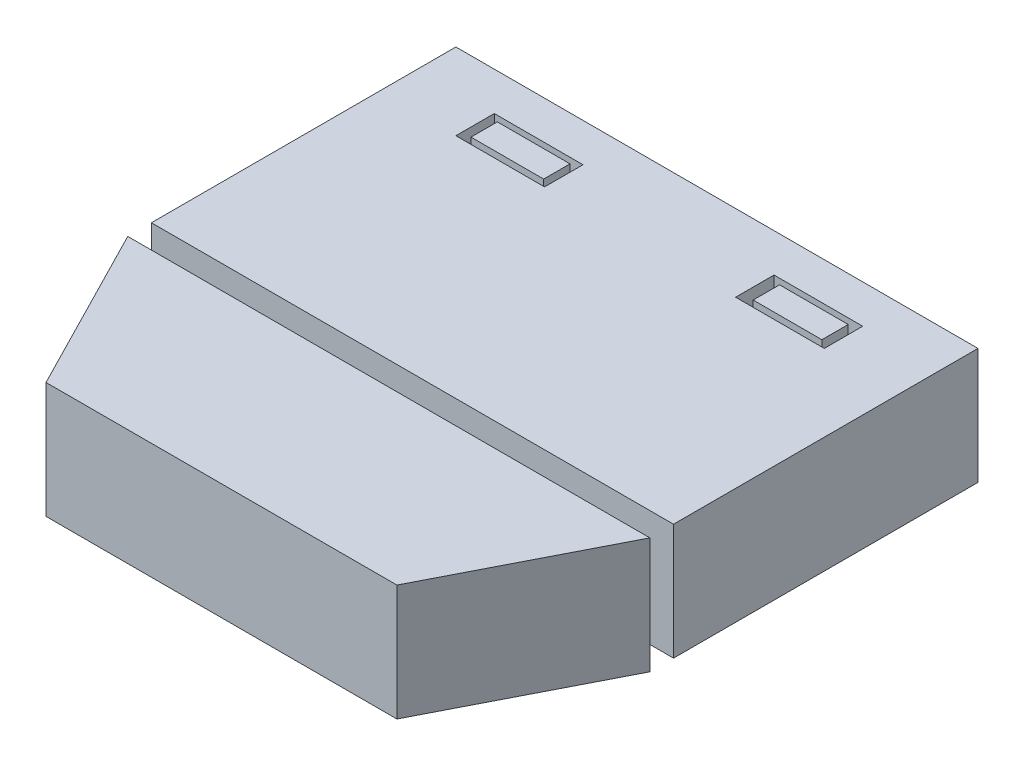
ISO-10303-21;
HEADER;
FILE_DESCRIPTION(('STEP AP214'),'2;1');
FILE_NAME('part.step','',(''),(''),'','','');
FILE_SCHEMA(('AUTOMOTIVE_DESIGN { 1 0 10303 214 1 1 1 1 }'));
ENDSEC;
DATA;
#1=APPLICATION_CONTEXT('core data for automotive mechanical design processes');
#2=APPLICATION_PROTOCOL_DEFINITION('international standard','automotive_design',2000,#1);
#3=PRODUCT_CONTEXT('',#1,'mechanical');
#4=PRODUCT('Part','Part','',(#3));
#5=PRODUCT_RELATED_PRODUCT_CATEGORY('part','',(#4));
#6=PRODUCT_DEFINITION_FORMATION('','',#4);
#7=PRODUCT_DEFINITION_CONTEXT('part definition',#1,'design');
#8=PRODUCT_DEFINITION('design','',#6,#7);
#9=PRODUCT_DEFINITION_SHAPE('','',#8);
#10=(LENGTH_UNIT() NAMED_UNIT(*) SI_UNIT(.MILLI.,.METRE.));
#11=(NAMED_UNIT(*) PLANE_ANGLE_UNIT() SI_UNIT($,.RADIAN.));
#12=(NAMED_UNIT(*) SI_UNIT($,.STERADIAN.) SOLID_ANGLE_UNIT());
#13=UNCERTAINTY_MEASURE_WITH_UNIT(LENGTH_MEASURE(1.E-05),#10,'distance_accuracy_value','');
#14=(GEOMETRIC_REPRESENTATION_CONTEXT(3) GLOBAL_UNCERTAINTY_ASSIGNED_CONTEXT((#13)) GLOBAL_UNIT_ASSIGNED_CONTEXT((#10,
#11,#12)) REPRESENTATION_CONTEXT('',''));
#15=CARTESIAN_POINT('',(0.,0.,0.));
#16=DIRECTION('',(0.,0.,1.));
#17=DIRECTION('',(1.,0.,0.));
#18=AXIS2_PLACEMENT_3D('',#15,#16,#17);
#19=CARTESIAN_POINT('',(37.6223812938265,10.,0.));
#20=DIRECTION('',(1.,0.,0.));
#21=DIRECTION('',(0.,0.,-1.));
#22=AXIS2_PLACEMENT_3D('',#19,#20,#21);
#23=PLANE('',#22);
#24=DIRECTION('',(0.,0.,1.));
#25=VECTOR('',#24,1.);
#26=CARTESIAN_POINT('',(37.6223812938265,0.,0.));
#27=LINE('',#26,#25);
#28=CARTESIAN_POINT('',(37.6223812938265,0.,-36.1945227365171));
#29=VERTEX_POINT('',#28);
#30=CARTESIAN_POINT('',(37.6223812938265,0.,-33.9231361325053));
#31=VERTEX_POINT('',#30);
#32=EDGE_CURVE('E160',#29,#31,#27,.T.);
#33=ORIENTED_EDGE('',*,*,#32,.F.);
#34=DIRECTION('',(0.,-1.,0.));
#35=VECTOR('',#34,1.);
#36=CARTESIAN_POINT('',(37.6223812938265,10.,-36.1945227365171));
#37=LINE('',#36,#35);
#38=CARTESIAN_POINT('',(37.6223812938265,10.,-36.1945227365171));
#39=VERTEX_POINT('',#38);
#40=EDGE_CURVE('E13',#39,#29,#37,.T.);
#41=ORIENTED_EDGE('',*,*,#40,.F.);
#42=DIRECTION('',(0.,0.,1.));
#43=VECTOR('',#42,1.);
#44=CARTESIAN_POINT('',(37.6223812938265,10.,0.));
#45=LINE('',#44,#43);
#46=CARTESIAN_POINT('',(37.6223812938265,10.,-33.9231361325053));
#47=VERTEX_POINT('',#46);
#48=EDGE_CURVE('E154',#39,#47,#45,.T.);
#49=ORIENTED_EDGE('',*,*,#48,.T.);
#50=DIRECTION('',(0.,-1.,0.));
#51=VECTOR('',#50,1.);
#52=CARTESIAN_POINT('',(37.6223812938265,10.,-33.9231361325053));
#53=LINE('',#52,#51);
#54=EDGE_CURVE('E135',#47,#31,#53,.T.);
#55=ORIENTED_EDGE('',*,*,#54,.T.);
#56=EDGE_LOOP('',(#33,#41,#49,#55));
#57=FACE_BOUND('',#56,.T.);
#58=ADVANCED_FACE('F97',(#57),#23,.T.);
#59=CARTESIAN_POINT('',(0.,10.,-36.1945227365171));
#60=DIRECTION('',(0.,0.,-1.));
#61=DIRECTION('',(-1.,0.,0.));
#62=AXIS2_PLACEMENT_3D('',#59,#60,#61);
#63=PLANE('',#62);
#64=DIRECTION('',(1.,0.,0.));
#65=VECTOR('',#64,1.);
#66=CARTESIAN_POINT('',(0.,0.,-36.1945227365171));
#67=LINE('',#66,#65);
#68=CARTESIAN_POINT('',(31.6991157462479,0.,-36.1945227365171));
#69=VERTEX_POINT('',#68);
#70=EDGE_CURVE('E148',#69,#29,#67,.T.);
#71=ORIENTED_EDGE('',*,*,#70,.F.);
#72=DIRECTION('',(0.,-1.,0.));
#73=VECTOR('',#72,1.);
#74=CARTESIAN_POINT('',(31.6991157462479,10.,-36.1945227365171));
#75=LINE('',#74,#73);
#76=CARTESIAN_POINT('',(31.6991157462479,10.,-36.1945227365171));
#77=VERTEX_POINT('',#76);
#78=EDGE_CURVE('E105',#77,#69,#75,.T.);
#79=ORIENTED_EDGE('',*,*,#78,.F.);
#80=DIRECTION('',(1.,0.,0.));
#81=VECTOR('',#80,1.);
#82=CARTESIAN_POINT('',(0.,10.,-36.1945227365171));
#83=LINE('',#82,#81);
#84=EDGE_CURVE('E146',#77,#39,#83,.T.);
#85=ORIENTED_EDGE('',*,*,#84,.T.);
#86=ORIENTED_EDGE('',*,*,#40,.T.);
#87=EDGE_LOOP('',(#71,#79,#85,#86));
#88=FACE_BOUND('',#87,.T.);
#89=ADVANCED_FACE('F144',(#88),#63,.T.);
#90=CARTESIAN_POINT('',(31.6991157462479,10.,0.));
#91=DIRECTION('',(1.,0.,0.));
#92=DIRECTION('',(0.,0.,-1.));
#93=AXIS2_PLACEMENT_3D('',#90,#91,#92);
#94=PLANE('',#93);
#95=DIRECTION('',(0.,0.,1.));
#96=VECTOR('',#95,1.);
#97=CARTESIAN_POINT('',(31.6991157462479,0.,0.));
#98=LINE('',#97,#96);
#99=CARTESIAN_POINT('',(31.6991157462479,0.,-33.9231361325053));
#100=VERTEX_POINT('',#99);
#101=EDGE_CURVE('E128',#69,#100,#98,.T.);
#102=ORIENTED_EDGE('',*,*,#101,.T.);
#103=DIRECTION('',(0.,-1.,0.));
#104=VECTOR('',#103,1.);
#105=CARTESIAN_POINT('',(31.6991157462479,10.,-33.9231361325053));
#106=LINE('',#105,#104);
#107=CARTESIAN_POINT('',(31.6991157462479,10.,-33.9231361325053));
#108=VERTEX_POINT('',#107);
#109=EDGE_CURVE('E149',#108,#100,#106,.T.);
#110=ORIENTED_EDGE('',*,*,#109,.F.);
#111=DIRECTION('',(0.,0.,1.));
#112=VECTOR('',#111,1.);
#113=CARTESIAN_POINT('',(31.6991157462479,10.,0.));
#114=LINE('',#113,#112);
#115=EDGE_CURVE('E150',#77,#108,#114,.T.);
#116=ORIENTED_EDGE('',*,*,#115,.F.);
#117=ORIENTED_EDGE('',*,*,#78,.T.);
#118=EDGE_LOOP('',(#102,#110,#116,#117));
#119=FACE_BOUND('',#118,.T.);
#120=ADVANCED_FACE('F151',(#119),#94,.F.);
#121=CARTESIAN_POINT('',(0.,10.,-33.9231361325053));
#122=DIRECTION('',(0.,0.,-1.));
#123=DIRECTION('',(-1.,0.,0.));
#124=AXIS2_PLACEMENT_3D('',#121,#122,#123);
#125=PLANE('',#124);
#126=DIRECTION('',(1.,0.,0.));
#127=VECTOR('',#126,1.);
#128=CARTESIAN_POINT('',(0.,0.,-33.9231361325053));
#129=LINE('',#128,#127);
#130=EDGE_CURVE('E156',#100,#31,#129,.T.);
#131=ORIENTED_EDGE('',*,*,#130,.T.);
#132=ORIENTED_EDGE('',*,*,#54,.F.);
#133=DIRECTION('',(1.,0.,0.));
#134=VECTOR('',#133,1.);
#135=CARTESIAN_POINT('',(0.,10.,-33.9231361325053));
#136=LINE('',#135,#134);
#137=EDGE_CURVE('E113',#108,#47,#136,.T.);
#138=ORIENTED_EDGE('',*,*,#137,.F.);
#139=ORIENTED_EDGE('',*,*,#109,.T.);
#140=EDGE_LOOP('',(#131,#132,#138,#139));
#141=FACE_BOUND('',#140,.T.);
#142=ADVANCED_FACE('F169',(#141),#125,.F.);
#143=CARTESIAN_POINT('',(0.,10.,0.));
#144=DIRECTION('',(0.,1.,0.));
#145=DIRECTION('',(0.,0.,1.));
#146=AXIS2_PLACEMENT_3D('',#143,#144,#145);
#147=PLANE('',#146);
#148=ORIENTED_EDGE('',*,*,#48,.F.);
#149=ORIENTED_EDGE('',*,*,#84,.F.);
#150=ORIENTED_EDGE('',*,*,#115,.T.);
#151=ORIENTED_EDGE('',*,*,#137,.T.);
#152=EDGE_LOOP('',(#148,#149,#150,#151));
#153=FACE_BOUND('',#152,.T.);
#154=ADVANCED_FACE('F153',(#153),#147,.T.);
#155=CARTESIAN_POINT('',(0.,0.,0.));
#156=DIRECTION('',(0.,1.,0.));
#157=DIRECTION('',(0.,0.,1.));
#158=AXIS2_PLACEMENT_3D('',#155,#156,#157);
#159=PLANE('',#158);
#160=ORIENTED_EDGE('',*,*,#32,.T.);
#161=ORIENTED_EDGE('',*,*,#130,.F.);
#162=ORIENTED_EDGE('',*,*,#101,.F.);
#163=ORIENTED_EDGE('',*,*,#70,.T.);
#164=EDGE_LOOP('',(#160,#161,#162,#163));
#165=FACE_BOUND('',#164,.T.);
#166=ADVANCED_FACE('F171',(#165),#159,.F.);
#167=CLOSED_SHELL('',(#58,#89,#120,#142,#154,#166));
#168=MANIFOLD_SOLID_BREP('B2',#167);
#169=CARTESIAN_POINT('',(13.6415922443539,10.,0.));
#170=DIRECTION('',(1.,0.,0.));
#171=DIRECTION('',(0.,0.,-1.));
#172=AXIS2_PLACEMENT_3D('',#169,#170,#171);
#173=PLANE('',#172);
#174=DIRECTION('',(0.,0.,1.));
#175=VECTOR('',#174,1.);
#176=CARTESIAN_POINT('',(13.6415922443539,0.,0.));
#177=LINE('',#176,#175);
#178=CARTESIAN_POINT('',(13.6415922443539,0.,-36.1945227365171));
#179=VERTEX_POINT('',#178);
#180=CARTESIAN_POINT('',(13.6415922443539,0.,-33.9231361325053));
#181=VERTEX_POINT('',#180);
#182=EDGE_CURVE('E305',#179,#181,#177,.T.);
#183=ORIENTED_EDGE('',*,*,#182,.F.);
#184=DIRECTION('',(0.,-1.,0.));
#185=VECTOR('',#184,1.);
#186=CARTESIAN_POINT('',(13.6415922443539,10.,-36.1945227365171));
#187=LINE('',#186,#185);
#188=CARTESIAN_POINT('',(13.6415922443539,10.,-36.1945227365171));
#189=VERTEX_POINT('',#188);
#190=EDGE_CURVE('E95',#189,#179,#187,.T.);
#191=ORIENTED_EDGE('',*,*,#190,.F.);
#192=DIRECTION('',(0.,0.,1.));
#193=VECTOR('',#192,1.);
#194=CARTESIAN_POINT('',(13.6415922443539,10.,0.));
#195=LINE('',#194,#193);
#196=CARTESIAN_POINT('',(13.6415922443539,10.,-33.9231361325053));
#197=VERTEX_POINT('',#196);
#198=EDGE_CURVE('E299',#189,#197,#195,.T.);
#199=ORIENTED_EDGE('',*,*,#198,.T.);
#200=DIRECTION('',(0.,-1.,0.));
#201=VECTOR('',#200,1.);
#202=CARTESIAN_POINT('',(13.6415922443539,10.,-33.9231361325053));
#203=LINE('',#202,#201);
#204=EDGE_CURVE('E280',#197,#181,#203,.T.);
#205=ORIENTED_EDGE('',*,*,#204,.T.);
#206=EDGE_LOOP('',(#183,#191,#199,#205));
#207=FACE_BOUND('',#206,.T.);
#208=ADVANCED_FACE('F242',(#207),#173,.T.);
#209=CARTESIAN_POINT('',(0.,10.,-36.1945227365171));
#210=DIRECTION('',(0.,0.,-1.));
#211=DIRECTION('',(-1.,0.,0.));
#212=AXIS2_PLACEMENT_3D('',#209,#210,#211);
#213=PLANE('',#212);
#214=DIRECTION('',(1.,0.,0.));
#215=VECTOR('',#214,1.);
#216=CARTESIAN_POINT('',(0.,0.,-36.1945227365171));
#217=LINE('',#216,#215);
#218=CARTESIAN_POINT('',(7.3776187061735,0.,-36.1945227365171));
#219=VERTEX_POINT('',#218);
#220=EDGE_CURVE('E293',#219,#179,#217,.T.);
#221=ORIENTED_EDGE('',*,*,#220,.F.);
#222=DIRECTION('',(0.,-1.,0.));
#223=VECTOR('',#222,1.);
#224=CARTESIAN_POINT('',(7.3776187061735,10.,-36.1945227365171));
#225=LINE('',#224,#223);
#226=CARTESIAN_POINT('',(7.3776187061735,10.,-36.1945227365171));
#227=VERTEX_POINT('',#226);
#228=EDGE_CURVE('E250',#227,#219,#225,.T.);
#229=ORIENTED_EDGE('',*,*,#228,.F.);
#230=DIRECTION('',(1.,0.,0.));
#231=VECTOR('',#230,1.);
#232=CARTESIAN_POINT('',(0.,10.,-36.1945227365171));
#233=LINE('',#232,#231);
#234=EDGE_CURVE('E291',#227,#189,#233,.T.);
#235=ORIENTED_EDGE('',*,*,#234,.T.);
#236=ORIENTED_EDGE('',*,*,#190,.T.);
#237=EDGE_LOOP('',(#221,#229,#235,#236));
#238=FACE_BOUND('',#237,.T.);
#239=ADVANCED_FACE('F289',(#238),#213,.T.);
#240=CARTESIAN_POINT('',(7.3776187061735,10.,0.));
#241=DIRECTION('',(1.,0.,0.));
#242=DIRECTION('',(0.,0.,-1.));
#243=AXIS2_PLACEMENT_3D('',#240,#241,#242);
#244=PLANE('',#243);
#245=DIRECTION('',(0.,0.,1.));
#246=VECTOR('',#245,1.);
#247=CARTESIAN_POINT('',(7.3776187061735,0.,0.));
#248=LINE('',#247,#246);
#249=CARTESIAN_POINT('',(7.3776187061735,0.,-33.9231361325053));
#250=VERTEX_POINT('',#249);
#251=EDGE_CURVE('E273',#219,#250,#248,.T.);
#252=ORIENTED_EDGE('',*,*,#251,.T.);
#253=DIRECTION('',(0.,-1.,0.));
#254=VECTOR('',#253,1.);
#255=CARTESIAN_POINT('',(7.3776187061735,10.,-33.9231361325053));
#256=LINE('',#255,#254);
#257=CARTESIAN_POINT('',(7.3776187061735,10.,-33.9231361325053));
#258=VERTEX_POINT('',#257);
#259=EDGE_CURVE('E294',#258,#250,#256,.T.);
#260=ORIENTED_EDGE('',*,*,#259,.F.);
#261=DIRECTION('',(0.,0.,1.));
#262=VECTOR('',#261,1.);
#263=CARTESIAN_POINT('',(7.3776187061735,10.,0.));
#264=LINE('',#263,#262);
#265=EDGE_CURVE('E295',#227,#258,#264,.T.);
#266=ORIENTED_EDGE('',*,*,#265,.F.);
#267=ORIENTED_EDGE('',*,*,#228,.T.);
#268=EDGE_LOOP('',(#252,#260,#266,#267));
#269=FACE_BOUND('',#268,.T.);
#270=ADVANCED_FACE('F296',(#269),#244,.F.);
#271=CARTESIAN_POINT('',(0.,10.,-33.9231361325053));
#272=DIRECTION('',(0.,0.,-1.));
#273=DIRECTION('',(-1.,0.,0.));
#274=AXIS2_PLACEMENT_3D('',#271,#272,#273);
#275=PLANE('',#274);
#276=DIRECTION('',(1.,0.,0.));
#277=VECTOR('',#276,1.);
#278=CARTESIAN_POINT('',(0.,0.,-33.9231361325053));
#279=LINE('',#278,#277);
#280=EDGE_CURVE('E301',#250,#181,#279,.T.);
#281=ORIENTED_EDGE('',*,*,#280,.T.);
#282=ORIENTED_EDGE('',*,*,#204,.F.);
#283=DIRECTION('',(1.,0.,0.));
#284=VECTOR('',#283,1.);
#285=CARTESIAN_POINT('',(0.,10.,-33.9231361325053));
#286=LINE('',#285,#284);
#287=EDGE_CURVE('E258',#258,#197,#286,.T.);
#288=ORIENTED_EDGE('',*,*,#287,.F.);
#289=ORIENTED_EDGE('',*,*,#259,.T.);
#290=EDGE_LOOP('',(#281,#282,#288,#289));
#291=FACE_BOUND('',#290,.T.);
#292=ADVANCED_FACE('F314',(#291),#275,.F.);
#293=CARTESIAN_POINT('',(0.,10.,0.));
#294=DIRECTION('',(0.,1.,0.));
#295=DIRECTION('',(0.,0.,1.));
#296=AXIS2_PLACEMENT_3D('',#293,#294,#295);
#297=PLANE('',#296);
#298=ORIENTED_EDGE('',*,*,#198,.F.);
#299=ORIENTED_EDGE('',*,*,#234,.F.);
#300=ORIENTED_EDGE('',*,*,#265,.T.);
#301=ORIENTED_EDGE('',*,*,#287,.T.);
#302=EDGE_LOOP('',(#298,#299,#300,#301));
#303=FACE_BOUND('',#302,.T.);
#304=ADVANCED_FACE('F298',(#303),#297,.T.);
#305=CARTESIAN_POINT('',(0.,0.,0.));
#306=DIRECTION('',(0.,1.,0.));
#307=DIRECTION('',(0.,0.,1.));
#308=AXIS2_PLACEMENT_3D('',#305,#306,#307);
#309=PLANE('',#308);
#310=ORIENTED_EDGE('',*,*,#182,.T.);
#311=ORIENTED_EDGE('',*,*,#280,.F.);
#312=ORIENTED_EDGE('',*,*,#251,.F.);
#313=ORIENTED_EDGE('',*,*,#220,.T.);
#314=EDGE_LOOP('',(#310,#311,#312,#313));
#315=FACE_BOUND('',#314,.T.);
#316=ADVANCED_FACE('F316',(#315),#309,.F.);
#317=CLOSED_SHELL('',(#208,#239,#270,#292,#304,#316));
#318=MANIFOLD_SOLID_BREP('B7',#317);
#319=CARTESIAN_POINT('',(0.,10.,-13.7579617834395));
#320=DIRECTION('',(0.,0.,-1.));
#321=DIRECTION('',(-1.,0.,0.));
#322=AXIS2_PLACEMENT_3D('',#319,#320,#321);
#323=PLANE('',#322);
#324=DIRECTION('',(1.,0.,0.));
#325=VECTOR('',#324,1.);
#326=CARTESIAN_POINT('',(0.,0.,-13.7579617834395));
#327=LINE('',#326,#325);
#328=CARTESIAN_POINT('',(0.,0.,-13.7579617834395));
#329=VERTEX_POINT('',#328);
#330=CARTESIAN_POINT('',(45.,0.,-13.7579617834395));
#331=VERTEX_POINT('',#330);
#332=EDGE_CURVE('E529',#329,#331,#327,.T.);
#333=ORIENTED_EDGE('',*,*,#332,.T.);
#334=DIRECTION('',(0.,-1.,0.));
#335=VECTOR('',#334,1.);
#336=CARTESIAN_POINT('',(45.,10.,-13.7579617834395));
#337=LINE('',#336,#335);
#338=CARTESIAN_POINT('',(45.,10.,-13.7579617834395));
#339=VERTEX_POINT('',#338);
#340=EDGE_CURVE('E240',#339,#331,#337,.T.);
#341=ORIENTED_EDGE('',*,*,#340,.F.);
#342=DIRECTION('',(1.,0.,0.));
#343=VECTOR('',#342,1.);
#344=CARTESIAN_POINT('',(0.,10.,-13.7579617834395));
#345=LINE('',#344,#343);
#346=CARTESIAN_POINT('',(0.,10.,-13.7579617834395));
#347=VERTEX_POINT('',#346);
#348=EDGE_CURVE('E489',#347,#339,#345,.T.);
#349=ORIENTED_EDGE('',*,*,#348,.F.);
#350=DIRECTION('',(0.,-1.,0.));
#351=VECTOR('',#350,1.);
#352=CARTESIAN_POINT('',(0.,10.,-13.7579617834395));
#353=LINE('',#352,#351);
#354=EDGE_CURVE('E405',#347,#329,#353,.T.);
#355=ORIENTED_EDGE('',*,*,#354,.T.);
#356=EDGE_LOOP('',(#333,#341,#349,#355));
#357=FACE_BOUND('',#356,.T.);
#358=ADVANCED_FACE('F386',(#357),#323,.F.);
#359=CARTESIAN_POINT('',(45.,10.,0.));
#360=DIRECTION('',(-1.,0.,0.));
#361=DIRECTION('',(0.,0.,1.));
#362=AXIS2_PLACEMENT_3D('',#359,#360,#361);
#363=PLANE('',#362);
#364=DIRECTION('',(0.,0.,-1.));
#365=VECTOR('',#364,1.);
#366=CARTESIAN_POINT('',(45.,0.,0.));
#367=LINE('',#366,#365);
#368=CARTESIAN_POINT('',(45.,0.,-40.));
#369=VERTEX_POINT('',#368);
#370=EDGE_CURVE('E495',#331,#369,#367,.T.);
#371=ORIENTED_EDGE('',*,*,#370,.T.);
#372=DIRECTION('',(0.,-1.,0.));
#373=VECTOR('',#372,1.);
#374=CARTESIAN_POINT('',(45.,10.,-40.));
#375=LINE('',#374,#373);
#376=CARTESIAN_POINT('',(45.,10.,-40.));
#377=VERTEX_POINT('',#376);
#378=EDGE_CURVE('E396',#377,#369,#375,.T.);
#379=ORIENTED_EDGE('',*,*,#378,.F.);
#380=DIRECTION('',(0.,0.,-1.));
#381=VECTOR('',#380,1.);
#382=CARTESIAN_POINT('',(45.,10.,0.));
#383=LINE('',#382,#381);
#384=EDGE_CURVE('E483',#339,#377,#383,.T.);
#385=ORIENTED_EDGE('',*,*,#384,.F.);
#386=ORIENTED_EDGE('',*,*,#340,.T.);
#387=EDGE_LOOP('',(#371,#379,#385,#386));
#388=FACE_BOUND('',#387,.T.);
#389=ADVANCED_FACE('F494',(#388),#363,.F.);
#390=CARTESIAN_POINT('',(0.,10.,-40.));
#391=DIRECTION('',(0.,0.,-1.));
#392=DIRECTION('',(-1.,0.,0.));
#393=AXIS2_PLACEMENT_3D('',#390,#391,#392);
#394=PLANE('',#393);
#395=DIRECTION('',(1.,0.,0.));
#396=VECTOR('',#395,1.);
#397=CARTESIAN_POINT('',(0.,0.,-40.));
#398=LINE('',#397,#396);
#399=CARTESIAN_POINT('',(0.,0.,-40.));
#400=VERTEX_POINT('',#399);
#401=EDGE_CURVE('E532',#400,#369,#398,.T.);
#402=ORIENTED_EDGE('',*,*,#401,.F.);
#403=DIRECTION('',(0.,-1.,0.));
#404=VECTOR('',#403,1.);
#405=CARTESIAN_POINT('',(0.,10.,-40.));
#406=LINE('',#405,#404);
#407=CARTESIAN_POINT('',(0.,10.,-40.));
#408=VERTEX_POINT('',#407);
#409=EDGE_CURVE('E443',#408,#400,#406,.T.);
#410=ORIENTED_EDGE('',*,*,#409,.F.);
#411=DIRECTION('',(1.,0.,0.));
#412=VECTOR('',#411,1.);
#413=CARTESIAN_POINT('',(0.,10.,-40.));
#414=LINE('',#413,#412);
#415=EDGE_CURVE('E488',#408,#377,#414,.T.);
#416=ORIENTED_EDGE('',*,*,#415,.T.);
#417=ORIENTED_EDGE('',*,*,#378,.T.);
#418=EDGE_LOOP('',(#402,#410,#416,#417));
#419=FACE_BOUND('',#418,.T.);
#420=ADVANCED_FACE('F499',(#419),#394,.T.);
#421=CARTESIAN_POINT('',(0.,10.,-36.687898089172));
#422=DIRECTION('',(0.,0.,-1.));
#423=DIRECTION('',(-1.,0.,0.));
#424=AXIS2_PLACEMENT_3D('',#421,#422,#423);
#425=PLANE('',#424);
#426=DIRECTION('',(1.,0.,0.));
#427=VECTOR('',#426,1.);
#428=CARTESIAN_POINT('',(0.,0.,-36.687898089172));
#429=LINE('',#428,#427);
#430=CARTESIAN_POINT('',(6.62420382165607,0.,-36.687898089172));
#431=VERTEX_POINT('',#430);
#432=CARTESIAN_POINT('',(14.2675159235669,0.,-36.687898089172));
#433=VERTEX_POINT('',#432);
#434=EDGE_CURVE('E517',#431,#433,#429,.T.);
#435=ORIENTED_EDGE('',*,*,#434,.T.);
#436=DIRECTION('',(0.,-1.,0.));
#437=VECTOR('',#436,1.);
#438=CARTESIAN_POINT('',(14.2675159235669,10.,-36.687898089172));
#439=LINE('',#438,#437);
#440=CARTESIAN_POINT('',(14.2675159235669,10.,-36.687898089172));
#441=VERTEX_POINT('',#440);
#442=EDGE_CURVE('E539',#441,#433,#439,.T.);
#443=ORIENTED_EDGE('',*,*,#442,.F.);
#444=DIRECTION('',(1.,0.,0.));
#445=VECTOR('',#444,1.);
#446=CARTESIAN_POINT('',(0.,10.,-36.687898089172));
#447=LINE('',#446,#445);
#448=CARTESIAN_POINT('',(6.62420382165607,10.,-36.687898089172));
#449=VERTEX_POINT('',#448);
#450=EDGE_CURVE('E737',#449,#441,#447,.T.);
#451=ORIENTED_EDGE('',*,*,#450,.F.);
#452=DIRECTION('',(0.,-1.,0.));
#453=VECTOR('',#452,1.);
#454=CARTESIAN_POINT('',(6.62420382165607,10.,-36.687898089172));
#455=LINE('',#454,#453);
#456=EDGE_CURVE('E541',#449,#431,#455,.T.);
#457=ORIENTED_EDGE('',*,*,#456,.T.);
#458=EDGE_LOOP('',(#435,#443,#451,#457));
#459=FACE_BOUND('',#458,.T.);
#460=ADVANCED_FACE('F598',(#459),#425,.F.);
#461=CARTESIAN_POINT('',(14.2675159235669,10.,0.));
#462=DIRECTION('',(1.,0.,0.));
#463=DIRECTION('',(0.,0.,-1.));
#464=AXIS2_PLACEMENT_3D('',#461,#462,#463);
#465=PLANE('',#464);
#466=DIRECTION('',(0.,0.,1.));
#467=VECTOR('',#466,1.);
#468=CARTESIAN_POINT('',(14.2675159235669,0.,0.));
#469=LINE('',#468,#467);
#470=CARTESIAN_POINT('',(14.2675159235669,0.,-33.3757961783439));
#471=VERTEX_POINT('',#470);
#472=EDGE_CURVE('E520',#433,#471,#469,.T.);
#473=ORIENTED_EDGE('',*,*,#472,.T.);
#474=DIRECTION('',(0.,-1.,0.));
#475=VECTOR('',#474,1.);
#476=CARTESIAN_POINT('',(14.2675159235669,10.,-33.3757961783439));
#477=LINE('',#476,#475);
#478=CARTESIAN_POINT('',(14.2675159235669,10.,-33.3757961783439));
#479=VERTEX_POINT('',#478);
#480=EDGE_CURVE('E545',#479,#471,#477,.T.);
#481=ORIENTED_EDGE('',*,*,#480,.F.);
#482=DIRECTION('',(0.,0.,1.));
#483=VECTOR('',#482,1.);
#484=CARTESIAN_POINT('',(14.2675159235669,10.,0.));
#485=LINE('',#484,#483);
#486=EDGE_CURVE('E735',#441,#479,#485,.T.);
#487=ORIENTED_EDGE('',*,*,#486,.F.);
#488=ORIENTED_EDGE('',*,*,#442,.T.);
#489=EDGE_LOOP('',(#473,#481,#487,#488));
#490=FACE_BOUND('',#489,.T.);
#491=ADVANCED_FACE('F594',(#490),#465,.F.);
#492=CARTESIAN_POINT('',(0.,10.,-33.3757961783439));
#493=DIRECTION('',(0.,0.,-1.));
#494=DIRECTION('',(-1.,0.,0.));
#495=AXIS2_PLACEMENT_3D('',#492,#493,#494);
#496=PLANE('',#495);
#497=DIRECTION('',(1.,0.,0.));
#498=VECTOR('',#497,1.);
#499=CARTESIAN_POINT('',(0.,0.,-33.3757961783439));
#500=LINE('',#499,#498);
#501=CARTESIAN_POINT('',(6.62420382165607,0.,-33.3757961783439));
#502=VERTEX_POINT('',#501);
#503=EDGE_CURVE('E523',#502,#471,#500,.T.);
#504=ORIENTED_EDGE('',*,*,#503,.F.);
#505=DIRECTION('',(0.,-1.,0.));
#506=VECTOR('',#505,1.);
#507=CARTESIAN_POINT('',(6.62420382165607,10.,-33.3757961783439));
#508=LINE('',#507,#506);
#509=CARTESIAN_POINT('',(6.62420382165607,10.,-33.3757961783439));
#510=VERTEX_POINT('',#509);
#511=EDGE_CURVE('E543',#510,#502,#508,.T.);
#512=ORIENTED_EDGE('',*,*,#511,.F.);
#513=DIRECTION('',(1.,0.,0.));
#514=VECTOR('',#513,1.);
#515=CARTESIAN_POINT('',(0.,10.,-33.3757961783439));
#516=LINE('',#515,#514);
#517=EDGE_CURVE('E730',#510,#479,#516,.T.);
#518=ORIENTED_EDGE('',*,*,#517,.T.);
#519=ORIENTED_EDGE('',*,*,#480,.T.);
#520=EDGE_LOOP('',(#504,#512,#518,#519));
#521=FACE_BOUND('',#520,.T.);
#522=ADVANCED_FACE('F591',(#521),#496,.T.);
#523=CARTESIAN_POINT('',(0.,10.,-36.687898089172));
#524=DIRECTION('',(0.,0.,1.));
#525=DIRECTION('',(1.,0.,0.));
#526=AXIS2_PLACEMENT_3D('',#523,#524,#525);
#527=PLANE('',#526);
#528=DIRECTION('',(-1.,0.,0.));
#529=VECTOR('',#528,1.);
#530=CARTESIAN_POINT('',(0.,0.,-36.687898089172));
#531=LINE('',#530,#529);
#532=CARTESIAN_POINT('',(38.3757961783439,0.,-36.687898089172));
#533=VERTEX_POINT('',#532);
#534=CARTESIAN_POINT('',(30.7324840764331,0.,-36.687898089172));
#535=VERTEX_POINT('',#534);
#536=EDGE_CURVE('E506',#533,#535,#531,.T.);
#537=ORIENTED_EDGE('',*,*,#536,.F.);
#538=DIRECTION('',(0.,-1.,0.));
#539=VECTOR('',#538,1.);
#540=CARTESIAN_POINT('',(38.3757961783439,10.,-36.687898089172));
#541=LINE('',#540,#539);
#542=CARTESIAN_POINT('',(38.3757961783439,10.,-36.687898089172));
#543=VERTEX_POINT('',#542);
#544=EDGE_CURVE('E390',#543,#533,#541,.T.);
#545=ORIENTED_EDGE('',*,*,#544,.F.);
#546=DIRECTION('',(-1.,0.,0.));
#547=VECTOR('',#546,1.);
#548=CARTESIAN_POINT('',(0.,10.,-36.687898089172));
#549=LINE('',#548,#547);
#550=CARTESIAN_POINT('',(30.7324840764331,10.,-36.687898089172));
#551=VERTEX_POINT('',#550);
#552=EDGE_CURVE('E537',#543,#551,#549,.T.);
#553=ORIENTED_EDGE('',*,*,#552,.T.);
#554=DIRECTION('',(0.,-1.,0.));
#555=VECTOR('',#554,1.);
#556=CARTESIAN_POINT('',(30.7324840764331,10.,-36.687898089172));
#557=LINE('',#556,#555);
#558=EDGE_CURVE('E502',#551,#535,#557,.T.);
#559=ORIENTED_EDGE('',*,*,#558,.T.);
#560=EDGE_LOOP('',(#537,#545,#553,#559));
#561=FACE_BOUND('',#560,.T.);
#562=ADVANCED_FACE('F388',(#561),#527,.T.);
#563=CARTESIAN_POINT('',(38.3757961783439,10.,0.));
#564=DIRECTION('',(1.,0.,0.));
#565=DIRECTION('',(0.,0.,-1.));
#566=AXIS2_PLACEMENT_3D('',#563,#564,#565);
#567=PLANE('',#566);
#568=DIRECTION('',(0.,0.,1.));
#569=VECTOR('',#568,1.);
#570=CARTESIAN_POINT('',(38.3757961783439,0.,0.));
#571=LINE('',#570,#569);
#572=CARTESIAN_POINT('',(38.3757961783439,0.,-33.3757961783439));
#573=VERTEX_POINT('',#572);
#574=EDGE_CURVE('E509',#533,#573,#571,.T.);
#575=ORIENTED_EDGE('',*,*,#574,.T.);
#576=DIRECTION('',(0.,-1.,0.));
#577=VECTOR('',#576,1.);
#578=CARTESIAN_POINT('',(38.3757961783439,10.,-33.3757961783439));
#579=LINE('',#578,#577);
#580=CARTESIAN_POINT('',(38.3757961783439,10.,-33.3757961783439));
#581=VERTEX_POINT('',#580);
#582=EDGE_CURVE('E551',#581,#573,#579,.T.);
#583=ORIENTED_EDGE('',*,*,#582,.F.);
#584=DIRECTION('',(0.,0.,1.));
#585=VECTOR('',#584,1.);
#586=CARTESIAN_POINT('',(38.3757961783439,10.,0.));
#587=LINE('',#586,#585);
#588=EDGE_CURVE('E560',#543,#581,#587,.T.);
#589=ORIENTED_EDGE('',*,*,#588,.F.);
#590=ORIENTED_EDGE('',*,*,#544,.T.);
#591=EDGE_LOOP('',(#575,#583,#589,#590));
#592=FACE_BOUND('',#591,.T.);
#593=ADVANCED_FACE('F559',(#592),#567,.F.);
#594=CARTESIAN_POINT('',(0.,10.,-33.3757961783439));
#595=DIRECTION('',(0.,0.,1.));
#596=DIRECTION('',(1.,0.,0.));
#597=AXIS2_PLACEMENT_3D('',#594,#595,#596);
#598=PLANE('',#597);
#599=DIRECTION('',(-1.,0.,0.));
#600=VECTOR('',#599,1.);
#601=CARTESIAN_POINT('',(0.,0.,-33.3757961783439));
#602=LINE('',#601,#600);
#603=CARTESIAN_POINT('',(30.7324840764331,0.,-33.3757961783439));
#604=VERTEX_POINT('',#603);
#605=EDGE_CURVE('E511',#573,#604,#602,.T.);
#606=ORIENTED_EDGE('',*,*,#605,.T.);
#607=DIRECTION('',(0.,-1.,0.));
#608=VECTOR('',#607,1.);
#609=CARTESIAN_POINT('',(30.7324840764331,10.,-33.3757961783439));
#610=LINE('',#609,#608);
#611=CARTESIAN_POINT('',(30.7324840764331,10.,-33.3757961783439));
#612=VERTEX_POINT('',#611);
#613=EDGE_CURVE('E550',#612,#604,#610,.T.);
#614=ORIENTED_EDGE('',*,*,#613,.F.);
#615=DIRECTION('',(-1.,0.,0.));
#616=VECTOR('',#615,1.);
#617=CARTESIAN_POINT('',(0.,10.,-33.3757961783439));
#618=LINE('',#617,#616);
#619=EDGE_CURVE('E741',#581,#612,#618,.T.);
#620=ORIENTED_EDGE('',*,*,#619,.F.);
#621=ORIENTED_EDGE('',*,*,#582,.T.);
#622=EDGE_LOOP('',(#606,#614,#620,#621));
#623=FACE_BOUND('',#622,.T.);
#624=ADVANCED_FACE('F572',(#623),#598,.F.);
#625=CARTESIAN_POINT('',(6.62420382165607,10.,0.));
#626=DIRECTION('',(1.,0.,0.));
#627=DIRECTION('',(0.,0.,-1.));
#628=AXIS2_PLACEMENT_3D('',#625,#626,#627);
#629=PLANE('',#628);
#630=DIRECTION('',(0.,0.,1.));
#631=VECTOR('',#630,1.);
#632=CARTESIAN_POINT('',(6.62420382165607,0.,0.));
#633=LINE('',#632,#631);
#634=EDGE_CURVE('E526',#431,#502,#633,.T.);
#635=ORIENTED_EDGE('',*,*,#634,.F.);
#636=ORIENTED_EDGE('',*,*,#456,.F.);
#637=DIRECTION('',(0.,0.,1.));
#638=VECTOR('',#637,1.);
#639=CARTESIAN_POINT('',(6.62420382165607,10.,0.));
#640=LINE('',#639,#638);
#641=EDGE_CURVE('E728',#449,#510,#640,.T.);
#642=ORIENTED_EDGE('',*,*,#641,.T.);
#643=ORIENTED_EDGE('',*,*,#511,.T.);
#644=EDGE_LOOP('',(#635,#636,#642,#643));
#645=FACE_BOUND('',#644,.T.);
#646=ADVANCED_FACE('F574',(#645),#629,.T.);
#647=CARTESIAN_POINT('',(30.7324840764331,10.,0.));
#648=DIRECTION('',(1.,0.,0.));
#649=DIRECTION('',(0.,0.,-1.));
#650=AXIS2_PLACEMENT_3D('',#647,#648,#649);
#651=PLANE('',#650);
#652=DIRECTION('',(0.,0.,1.));
#653=VECTOR('',#652,1.);
#654=CARTESIAN_POINT('',(30.7324840764331,0.,0.));
#655=LINE('',#654,#653);
#656=EDGE_CURVE('E514',#535,#604,#655,.T.);
#657=ORIENTED_EDGE('',*,*,#656,.F.);
#658=ORIENTED_EDGE('',*,*,#558,.F.);
#659=DIRECTION('',(0.,0.,1.));
#660=VECTOR('',#659,1.);
#661=CARTESIAN_POINT('',(30.7324840764331,10.,0.));
#662=LINE('',#661,#660);
#663=EDGE_CURVE('E570',#551,#612,#662,.T.);
#664=ORIENTED_EDGE('',*,*,#663,.T.);
#665=ORIENTED_EDGE('',*,*,#613,.T.);
#666=EDGE_LOOP('',(#657,#658,#664,#665));
#667=FACE_BOUND('',#666,.T.);
#668=ADVANCED_FACE('F569',(#667),#651,.T.);
#669=CARTESIAN_POINT('',(0.,10.,0.));
#670=DIRECTION('',(-1.,0.,0.));
#671=DIRECTION('',(0.,0.,1.));
#672=AXIS2_PLACEMENT_3D('',#669,#670,#671);
#673=PLANE('',#672);
#674=DIRECTION('',(0.,0.,-1.));
#675=VECTOR('',#674,1.);
#676=CARTESIAN_POINT('',(0.,0.,0.));
#677=LINE('',#676,#675);
#678=EDGE_CURVE('E534',#329,#400,#677,.T.);
#679=ORIENTED_EDGE('',*,*,#678,.F.);
#680=ORIENTED_EDGE('',*,*,#354,.F.);
#681=DIRECTION('',(0.,0.,-1.));
#682=VECTOR('',#681,1.);
#683=CARTESIAN_POINT('',(0.,10.,0.));
#684=LINE('',#683,#682);
#685=EDGE_CURVE('E500',#347,#408,#684,.T.);
#686=ORIENTED_EDGE('',*,*,#685,.T.);
#687=ORIENTED_EDGE('',*,*,#409,.T.);
#688=EDGE_LOOP('',(#679,#680,#686,#687));
#689=FACE_BOUND('',#688,.T.);
#690=ADVANCED_FACE('F603',(#689),#673,.T.);
#691=CARTESIAN_POINT('',(0.,10.,0.));
#692=DIRECTION('',(0.,1.,0.));
#693=DIRECTION('',(0.,0.,1.));
#694=AXIS2_PLACEMENT_3D('',#691,#692,#693);
#695=PLANE('',#694);
#696=ORIENTED_EDGE('',*,*,#552,.F.);
#697=ORIENTED_EDGE('',*,*,#588,.T.);
#698=ORIENTED_EDGE('',*,*,#619,.T.);
#699=ORIENTED_EDGE('',*,*,#663,.F.);
#700=EDGE_LOOP('',(#696,#697,#698,#699));
#701=FACE_BOUND('',#700,.T.);
#702=ORIENTED_EDGE('',*,*,#450,.T.);
#703=ORIENTED_EDGE('',*,*,#486,.T.);
#704=ORIENTED_EDGE('',*,*,#517,.F.);
#705=ORIENTED_EDGE('',*,*,#641,.F.);
#706=EDGE_LOOP('',(#702,#703,#704,#705));
#707=FACE_BOUND('',#706,.T.);
#708=ORIENTED_EDGE('',*,*,#348,.T.);
#709=ORIENTED_EDGE('',*,*,#384,.T.);
#710=ORIENTED_EDGE('',*,*,#415,.F.);
#711=ORIENTED_EDGE('',*,*,#685,.F.);
#712=EDGE_LOOP('',(#708,#709,#710,#711));
#713=FACE_BOUND('',#712,.T.);
#714=ADVANCED_FACE('F485',(#701,#707,#713),#695,.T.);
#715=CARTESIAN_POINT('',(0.,0.,0.));
#716=DIRECTION('',(0.,1.,0.));
#717=DIRECTION('',(0.,0.,1.));
#718=AXIS2_PLACEMENT_3D('',#715,#716,#717);
#719=PLANE('',#718);
#720=ORIENTED_EDGE('',*,*,#536,.T.);
#721=ORIENTED_EDGE('',*,*,#656,.T.);
#722=ORIENTED_EDGE('',*,*,#605,.F.);
#723=ORIENTED_EDGE('',*,*,#574,.F.);
#724=EDGE_LOOP('',(#720,#721,#722,#723));
#725=FACE_BOUND('',#724,.T.);
#726=ORIENTED_EDGE('',*,*,#434,.F.);
#727=ORIENTED_EDGE('',*,*,#634,.T.);
#728=ORIENTED_EDGE('',*,*,#503,.T.);
#729=ORIENTED_EDGE('',*,*,#472,.F.);
#730=EDGE_LOOP('',(#726,#727,#728,#729));
#731=FACE_BOUND('',#730,.T.);
#732=ORIENTED_EDGE('',*,*,#332,.F.);
#733=ORIENTED_EDGE('',*,*,#678,.T.);
#734=ORIENTED_EDGE('',*,*,#401,.T.);
#735=ORIENTED_EDGE('',*,*,#370,.F.);
#736=EDGE_LOOP('',(#732,#733,#734,#735));
#737=FACE_BOUND('',#736,.T.);
#738=ADVANCED_FACE('F563',(#725,#731,#737),#719,.F.);
#739=CLOSED_SHELL('',(#358,#389,#420,#460,#491,#522,#562,#593,#624,#646,#668,#690,#714,#738));
#740=MANIFOLD_SOLID_BREP('B89',#739);
#741=CARTESIAN_POINT('',(0.,10.,2.70387755894845));
#742=DIRECTION('',(0.,0.,-1.));
#743=DIRECTION('',(-1.,0.,0.));
#744=AXIS2_PLACEMENT_3D('',#741,#742,#743);
#745=PLANE('',#744);
#746=DIRECTION('',(1.,0.,0.));
#747=VECTOR('',#746,1.);
#748=CARTESIAN_POINT('',(0.,0.,2.70387755894845));
#749=LINE('',#748,#747);
#750=CARTESIAN_POINT('',(7.3776187061735,0.,2.70387755894845));
#751=VERTEX_POINT('',#750);
#752=CARTESIAN_POINT('',(37.6223812938265,0.,2.70387755894845));
#753=VERTEX_POINT('',#752);
#754=EDGE_CURVE('E818',#751,#753,#749,.T.);
#755=ORIENTED_EDGE('',*,*,#754,.T.);
#756=DIRECTION('',(0.,-1.,0.));
#757=VECTOR('',#756,1.);
#758=CARTESIAN_POINT('',(37.6223812938265,10.,2.70387755894845));
#759=LINE('',#758,#757);
#760=CARTESIAN_POINT('',(37.6223812938265,10.,2.70387755894845));
#761=VERTEX_POINT('',#760);
#762=EDGE_CURVE('E384',#761,#753,#759,.T.);
#763=ORIENTED_EDGE('',*,*,#762,.F.);
#764=DIRECTION('',(1.,0.,0.));
#765=VECTOR('',#764,1.);
#766=CARTESIAN_POINT('',(0.,10.,2.70387755894845));
#767=LINE('',#766,#765);
#768=CARTESIAN_POINT('',(7.3776187061735,10.,2.70387755894845));
#769=VERTEX_POINT('',#768);
#770=EDGE_CURVE('E797',#769,#761,#767,.T.);
#771=ORIENTED_EDGE('',*,*,#770,.F.);
#772=DIRECTION('',(0.,-1.,0.));
#773=VECTOR('',#772,1.);
#774=CARTESIAN_POINT('',(7.3776187061735,10.,2.70387755894845));
#775=LINE('',#774,#773);
#776=EDGE_CURVE('E817',#769,#751,#775,.T.);
#777=ORIENTED_EDGE('',*,*,#776,.T.);
#778=EDGE_LOOP('',(#755,#763,#771,#777));
#779=FACE_BOUND('',#778,.T.);
#780=ADVANCED_FACE('F755',(#779),#745,.F.);
#781=CARTESIAN_POINT('',(30.9167300536789,10.,15.8137694965448));
#782=DIRECTION('',(0.890295943387101,0.,0.455382403248601));
#783=DIRECTION('',(0.455382403248601,0.,-0.890295943387101));
#784=AXIS2_PLACEMENT_3D('',#781,#782,#783);
#785=PLANE('',#784);
#786=DIRECTION('',(-0.455382403248601,0.,0.890295943387101));
#787=VECTOR('',#786,1.);
#788=CARTESIAN_POINT('',(30.9167300536789,0.,15.8137694965448));
#789=LINE('',#788,#787);
#790=CARTESIAN_POINT('',(45.,0.,-11.7197452229299));
#791=VERTEX_POINT('',#790);
#792=EDGE_CURVE('E807',#791,#753,#789,.T.);
#793=ORIENTED_EDGE('',*,*,#792,.F.);
#794=DIRECTION('',(0.,-1.,0.));
#795=VECTOR('',#794,1.);
#796=CARTESIAN_POINT('',(45.,10.,-11.7197452229299));
#797=LINE('',#796,#795);
#798=CARTESIAN_POINT('',(45.,10.,-11.7197452229299));
#799=VERTEX_POINT('',#798);
#800=EDGE_CURVE('E763',#799,#791,#797,.T.);
#801=ORIENTED_EDGE('',*,*,#800,.F.);
#802=DIRECTION('',(-0.455382403248601,0.,0.890295943387101));
#803=VECTOR('',#802,1.);
#804=CARTESIAN_POINT('',(30.9167300536789,10.,15.8137694965448));
#805=LINE('',#804,#803);
#806=EDGE_CURVE('E805',#799,#761,#805,.T.);
#807=ORIENTED_EDGE('',*,*,#806,.T.);
#808=ORIENTED_EDGE('',*,*,#762,.T.);
#809=EDGE_LOOP('',(#793,#801,#807,#808));
#810=FACE_BOUND('',#809,.T.);
#811=ADVANCED_FACE('F804',(#810),#785,.T.);
#812=CARTESIAN_POINT('',(0.,10.,-11.7197452229299));
#813=DIRECTION('',(0.,0.,1.));
#814=DIRECTION('',(1.,0.,0.));
#815=AXIS2_PLACEMENT_3D('',#812,#813,#814);
#816=PLANE('',#815);
#817=DIRECTION('',(-1.,0.,0.));
#818=VECTOR('',#817,1.);
#819=CARTESIAN_POINT('',(0.,0.,-11.7197452229299));
#820=LINE('',#819,#818);
#821=CARTESIAN_POINT('',(0.,0.,-11.7197452229299));
#822=VERTEX_POINT('',#821);
#823=EDGE_CURVE('E786',#791,#822,#820,.T.);
#824=ORIENTED_EDGE('',*,*,#823,.T.);
#825=DIRECTION('',(0.,-1.,0.));
#826=VECTOR('',#825,1.);
#827=CARTESIAN_POINT('',(0.,10.,-11.7197452229299));
#828=LINE('',#827,#826);
#829=CARTESIAN_POINT('',(0.,10.,-11.7197452229299));
#830=VERTEX_POINT('',#829);
#831=EDGE_CURVE('E808',#830,#822,#828,.T.);
#832=ORIENTED_EDGE('',*,*,#831,.F.);
#833=DIRECTION('',(-1.,0.,0.));
#834=VECTOR('',#833,1.);
#835=CARTESIAN_POINT('',(0.,10.,-11.7197452229299));
#836=LINE('',#835,#834);
#837=EDGE_CURVE('E809',#799,#830,#836,.T.);
#838=ORIENTED_EDGE('',*,*,#837,.F.);
#839=ORIENTED_EDGE('',*,*,#800,.T.);
#840=EDGE_LOOP('',(#824,#832,#838,#839));
#841=FACE_BOUND('',#840,.T.);
#842=ADVANCED_FACE('F810',(#841),#816,.F.);
#843=CARTESIAN_POINT('',(4.75147895283989,10.,-2.43036028704961));
#844=DIRECTION('',(0.890295943387101,0.,-0.455382403248602));
#845=DIRECTION('',(-0.455382403248602,0.,-0.890295943387101));
#846=AXIS2_PLACEMENT_3D('',#843,#844,#845);
#847=PLANE('',#846);
#848=DIRECTION('',(0.455382403248602,0.,0.890295943387101));
#849=VECTOR('',#848,1.);
#850=CARTESIAN_POINT('',(4.75147895283989,0.,-2.43036028704961));
#851=LINE('',#850,#849);
#852=EDGE_CURVE('E792',#822,#751,#851,.T.);
#853=ORIENTED_EDGE('',*,*,#852,.T.);
#854=ORIENTED_EDGE('',*,*,#776,.F.);
#855=DIRECTION('',(0.455382403248602,0.,0.890295943387101));
#856=VECTOR('',#855,1.);
#857=CARTESIAN_POINT('',(4.75147895283989,10.,-2.43036028704961));
#858=LINE('',#857,#856);
#859=EDGE_CURVE('E771',#830,#769,#858,.T.);
#860=ORIENTED_EDGE('',*,*,#859,.F.);
#861=ORIENTED_EDGE('',*,*,#831,.T.);
#862=EDGE_LOOP('',(#853,#854,#860,#861));
#863=FACE_BOUND('',#862,.T.);
#864=ADVANCED_FACE('F825',(#863),#847,.F.);
#865=CARTESIAN_POINT('',(0.,10.,0.));
#866=DIRECTION('',(0.,1.,0.));
#867=DIRECTION('',(0.,0.,1.));
#868=AXIS2_PLACEMENT_3D('',#865,#866,#867);
#869=PLANE('',#868);
#870=ORIENTED_EDGE('',*,*,#770,.T.);
#871=ORIENTED_EDGE('',*,*,#806,.F.);
#872=ORIENTED_EDGE('',*,*,#837,.T.);
#873=ORIENTED_EDGE('',*,*,#859,.T.);
#874=EDGE_LOOP('',(#870,#871,#872,#873));
#875=FACE_BOUND('',#874,.T.);
#876=ADVANCED_FACE('F812',(#875),#869,.T.);
#877=CARTESIAN_POINT('',(0.,0.,0.));
#878=DIRECTION('',(0.,1.,0.));
#879=DIRECTION('',(0.,0.,1.));
#880=AXIS2_PLACEMENT_3D('',#877,#878,#879);
#881=PLANE('',#880);
#882=ORIENTED_EDGE('',*,*,#754,.F.);
#883=ORIENTED_EDGE('',*,*,#852,.F.);
#884=ORIENTED_EDGE('',*,*,#823,.F.);
#885=ORIENTED_EDGE('',*,*,#792,.T.);
#886=EDGE_LOOP('',(#882,#883,#884,#885));
#887=FACE_BOUND('',#886,.T.);
#888=ADVANCED_FACE('F828',(#887),#881,.F.);
#889=CLOSED_SHELL('',(#780,#811,#842,#864,#876,#888));
#890=MANIFOLD_SOLID_BREP('B234',#889);
#891=ADVANCED_BREP_SHAPE_REPRESENTATION('',(#18,#168,#318,#740,#890),#14);
#892=SHAPE_DEFINITION_REPRESENTATION(#9,#891);
ENDSEC;
END-ISO-10303-21;
